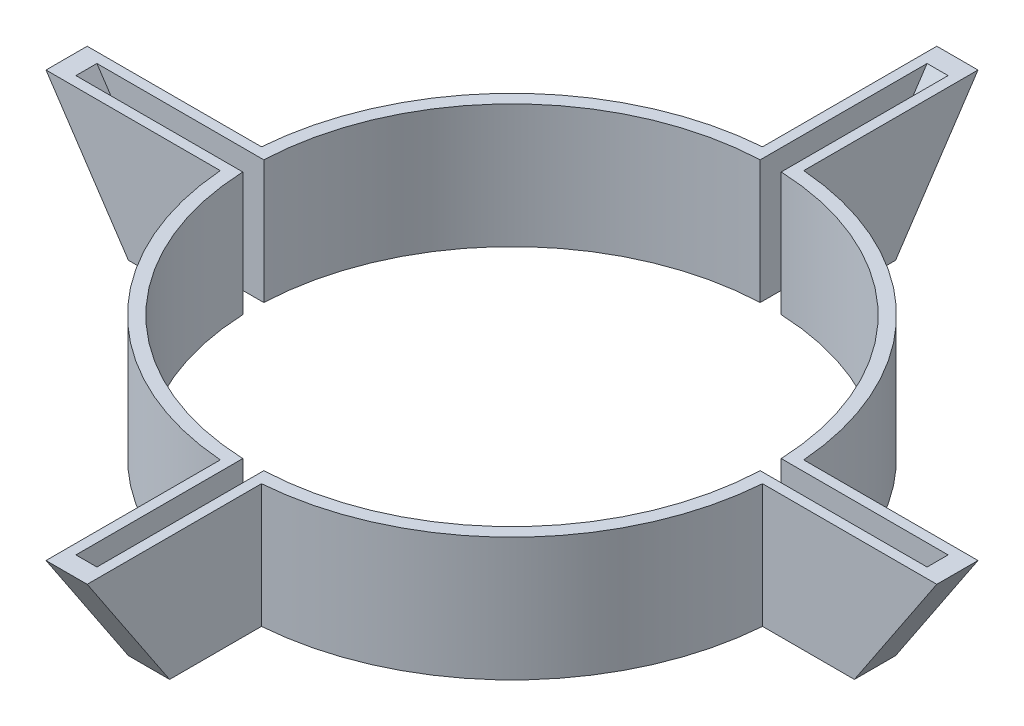
ISO-10303-21;
HEADER;
FILE_DESCRIPTION(('STEP AP214'),'2;1');
FILE_NAME('part.step','',(''),(''),'','','');
FILE_SCHEMA(('AUTOMOTIVE_DESIGN { 1 0 10303 214 1 1 1 1 }'));
ENDSEC;
DATA;
#1=APPLICATION_CONTEXT('core data for automotive mechanical design processes');
#2=APPLICATION_PROTOCOL_DEFINITION('international standard','automotive_design',2000,#1);
#3=PRODUCT_CONTEXT('',#1,'mechanical');
#4=PRODUCT('Part','Part','',(#3));
#5=PRODUCT_RELATED_PRODUCT_CATEGORY('part','',(#4));
#6=PRODUCT_DEFINITION_FORMATION('','',#4);
#7=PRODUCT_DEFINITION_CONTEXT('part definition',#1,'design');
#8=PRODUCT_DEFINITION('design','',#6,#7);
#9=PRODUCT_DEFINITION_SHAPE('','',#8);
#10=(LENGTH_UNIT() NAMED_UNIT(*) SI_UNIT(.MILLI.,.METRE.));
#11=(NAMED_UNIT(*) PLANE_ANGLE_UNIT() SI_UNIT($,.RADIAN.));
#12=(NAMED_UNIT(*) SI_UNIT($,.STERADIAN.) SOLID_ANGLE_UNIT());
#13=UNCERTAINTY_MEASURE_WITH_UNIT(LENGTH_MEASURE(1.E-05),#10,'distance_accuracy_value','');
#14=(GEOMETRIC_REPRESENTATION_CONTEXT(3) GLOBAL_UNCERTAINTY_ASSIGNED_CONTEXT((#13)) GLOBAL_UNIT_ASSIGNED_CONTEXT((#10,
#11,#12)) REPRESENTATION_CONTEXT('',''));
#15=CARTESIAN_POINT('',(0.,0.,0.));
#16=DIRECTION('',(0.,0.,1.));
#17=DIRECTION('',(1.,0.,0.));
#18=AXIS2_PLACEMENT_3D('',#15,#16,#17);
#19=CARTESIAN_POINT('',(-64.2083674284019,-78.044168561766,-1.61925000000022));
#20=DIRECTION('',(0.,0.,-1.));
#21=DIRECTION('',(-1.,0.,0.));
#22=AXIS2_PLACEMENT_3D('',#19,#20,#21);
#23=PLANE('',#22);
#24=DIRECTION('',(0.554699215611406,0.832050948079558,0.));
#25=VECTOR('',#24,1.);
#26=CARTESIAN_POINT('',(-8.36465421005174,-115.273215641808,-1.61925000000003));
#27=LINE('',#26,#25);
#28=CARTESIAN_POINT('',(52.8897682993931,-23.3913472550421,-1.61924999999986));
#29=VERTEX_POINT('',#28);
#30=CARTESIAN_POINT('',(65.5897358696324,-4.34134725504209,-1.61924999999986));
#31=VERTEX_POINT('',#30);
#32=EDGE_CURVE('E269',#29,#31,#27,.T.);
#33=ORIENTED_EDGE('',*,*,#32,.T.);
#34=DIRECTION('',(-1.,0.,0.));
#35=VECTOR('',#34,1.);
#36=CARTESIAN_POINT('',(-64.2083674284019,-4.34134725504209,-1.61925000000022));
#37=LINE('',#36,#35);
#38=CARTESIAN_POINT('',(39.8705324895154,-4.34134725504209,-1.61924999999986));
#39=VERTEX_POINT('',#38);
#40=EDGE_CURVE('E420',#31,#39,#37,.T.);
#41=ORIENTED_EDGE('',*,*,#40,.T.);
#42=DIRECTION('',(0.,-1.,0.));
#43=VECTOR('',#42,1.);
#44=CARTESIAN_POINT('',(39.8705324895154,57.15,-1.61924999999986));
#45=LINE('',#44,#43);
#46=CARTESIAN_POINT('',(39.8705324895154,-23.3913472550421,-1.61924999999986));
#47=VERTEX_POINT('',#46);
#48=EDGE_CURVE('E276',#47,#39,#45,.F.);
#49=ORIENTED_EDGE('',*,*,#48,.F.);
#50=DIRECTION('',(1.,0.,0.));
#51=VECTOR('',#50,1.);
#52=CARTESIAN_POINT('',(-64.2083674284019,-23.3913472550421,-1.61925000000022));
#53=LINE('',#52,#51);
#54=EDGE_CURVE('E419',#47,#29,#53,.T.);
#55=ORIENTED_EDGE('',*,*,#54,.T.);
#56=EDGE_LOOP('',(#33,#41,#49,#55));
#57=FACE_BOUND('',#56,.T.);
#58=ADVANCED_FACE('F43',(#57),#23,.F.);
#59=CARTESIAN_POINT('',(-64.2083674284019,-78.044168561766,1.61924999999978));
#60=DIRECTION('',(0.,0.,1.));
#61=DIRECTION('',(1.,0.,0.));
#62=AXIS2_PLACEMENT_3D('',#59,#60,#61);
#63=PLANE('',#62);
#64=DIRECTION('',(0.,-1.,0.));
#65=VECTOR('',#64,1.);
#66=CARTESIAN_POINT('',(39.8705324895154,57.15,1.61925000000014));
#67=LINE('',#66,#65);
#68=CARTESIAN_POINT('',(39.8705324895154,-4.34134725504209,1.61925000000014));
#69=VERTEX_POINT('',#68);
#70=CARTESIAN_POINT('',(39.8705324895154,-23.3913472550421,1.61925000000014));
#71=VERTEX_POINT('',#70);
#72=EDGE_CURVE('E272',#69,#71,#67,.T.);
#73=ORIENTED_EDGE('',*,*,#72,.F.);
#74=DIRECTION('',(1.,0.,0.));
#75=VECTOR('',#74,1.);
#76=CARTESIAN_POINT('',(-64.2083674284019,-4.34134725504209,1.61924999999978));
#77=LINE('',#76,#75);
#78=CARTESIAN_POINT('',(65.5897358696324,-4.34134725504209,1.61925000000023));
#79=VERTEX_POINT('',#78);
#80=EDGE_CURVE('E11',#69,#79,#77,.T.);
#81=ORIENTED_EDGE('',*,*,#80,.T.);
#82=DIRECTION('',(0.554699215611406,0.832050948079558,0.));
#83=VECTOR('',#82,1.);
#84=CARTESIAN_POINT('',(-8.36465421005174,-115.273215641808,1.61924999999997));
#85=LINE('',#84,#83);
#86=CARTESIAN_POINT('',(52.889768299393,-23.3913472550421,1.61925000000019));
#87=VERTEX_POINT('',#86);
#88=EDGE_CURVE('E267',#87,#79,#85,.T.);
#89=ORIENTED_EDGE('',*,*,#88,.F.);
#90=DIRECTION('',(-1.,0.,0.));
#91=VECTOR('',#90,1.);
#92=CARTESIAN_POINT('',(-64.2083674284019,-23.3913472550421,1.61924999999978));
#93=LINE('',#92,#91);
#94=EDGE_CURVE('E51',#87,#71,#93,.T.);
#95=ORIENTED_EDGE('',*,*,#94,.T.);
#96=EDGE_LOOP('',(#73,#81,#89,#95));
#97=FACE_BOUND('',#96,.T.);
#98=ADVANCED_FACE('F271',(#97),#63,.F.);
#99=CARTESIAN_POINT('',(-8.36465421005174,-115.273215641808,-1.61925000000003));
#100=DIRECTION('',(0.832050948079558,-0.554699215611406,0.));
#101=DIRECTION('',(0.554699215611406,0.832050948079558,0.));
#102=AXIS2_PLACEMENT_3D('',#99,#100,#101);
#103=PLANE('',#102);
#104=ORIENTED_EDGE('',*,*,#88,.T.);
#105=DIRECTION('',(0.,0.,-1.));
#106=VECTOR('',#105,1.);
#107=CARTESIAN_POINT('',(65.5897358696324,-4.34134725504209,-1.61924999999975));
#108=LINE('',#107,#106);
#109=EDGE_CURVE('E428',#79,#31,#108,.T.);
#110=ORIENTED_EDGE('',*,*,#109,.T.);
#111=ORIENTED_EDGE('',*,*,#32,.F.);
#112=DIRECTION('',(0.,0.,1.));
#113=VECTOR('',#112,1.);
#114=CARTESIAN_POINT('',(52.8897682993931,-23.3913472550421,-1.6192499999998));
#115=LINE('',#114,#113);
#116=EDGE_CURVE('E253',#29,#87,#115,.T.);
#117=ORIENTED_EDGE('',*,*,#116,.T.);
#118=EDGE_LOOP('',(#104,#110,#111,#117));
#119=FACE_BOUND('',#118,.T.);
#120=ADVANCED_FACE('F265',(#119),#103,.F.);
#121=CARTESIAN_POINT('',(-1.61925,-53.2855158173118,47.7026410799827));
#122=DIRECTION('',(-1.,0.,0.));
#123=DIRECTION('',(0.,0.,1.));
#124=AXIS2_PLACEMENT_3D('',#121,#122,#123);
#125=PLANE('',#124);
#126=DIRECTION('',(0.,0.832050948079557,-0.554699215611406));
#127=VECTOR('',#126,1.);
#128=CARTESIAN_POINT('',(-1.61925,-90.5145628973535,-8.14107213836744));
#129=LINE('',#128,#127);
#130=CARTESIAN_POINT('',(-1.61925,-23.3913472550421,-52.8897682993931));
#131=VERTEX_POINT('',#130);
#132=CARTESIAN_POINT('',(-1.61925,-4.34134725504208,-65.5897358696324));
#133=VERTEX_POINT('',#132);
#134=EDGE_CURVE('E346',#131,#133,#129,.T.);
#135=ORIENTED_EDGE('',*,*,#134,.T.);
#136=DIRECTION('',(0.,0.,1.));
#137=VECTOR('',#136,1.);
#138=CARTESIAN_POINT('',(-1.61925,-4.3413472550421,47.7026410799827));
#139=LINE('',#138,#137);
#140=CARTESIAN_POINT('',(-1.61925,-4.34134725504209,-39.8705324895154));
#141=VERTEX_POINT('',#140);
#142=EDGE_CURVE('E451',#133,#141,#139,.T.);
#143=ORIENTED_EDGE('',*,*,#142,.T.);
#144=DIRECTION('',(0.,-1.,0.));
#145=VECTOR('',#144,1.);
#146=CARTESIAN_POINT('',(-1.61925,57.15,-39.8705324895154));
#147=LINE('',#146,#145);
#148=CARTESIAN_POINT('',(-1.61925,-23.3913472550421,-39.8705324895153));
#149=VERTEX_POINT('',#148);
#150=EDGE_CURVE('E339',#149,#141,#147,.F.);
#151=ORIENTED_EDGE('',*,*,#150,.F.);
#152=DIRECTION('',(0.,0.,-1.));
#153=VECTOR('',#152,1.);
#154=CARTESIAN_POINT('',(-1.61925,-23.3913472550421,47.7026410799827));
#155=LINE('',#154,#153);
#156=EDGE_CURVE('E540',#149,#131,#155,.T.);
#157=ORIENTED_EDGE('',*,*,#156,.T.);
#158=EDGE_LOOP('',(#135,#143,#151,#157));
#159=FACE_BOUND('',#158,.T.);
#160=ADVANCED_FACE('F535',(#159),#125,.F.);
#161=CARTESIAN_POINT('',(1.61925,-53.2855158173118,47.7026410799827));
#162=DIRECTION('',(1.,0.,0.));
#163=DIRECTION('',(0.,0.,-1.));
#164=AXIS2_PLACEMENT_3D('',#161,#162,#163);
#165=PLANE('',#164);
#166=DIRECTION('',(0.,-1.,0.));
#167=VECTOR('',#166,1.);
#168=CARTESIAN_POINT('',(1.61925,57.15,-39.8705324895154));
#169=LINE('',#168,#167);
#170=CARTESIAN_POINT('',(1.61925,-4.34134725504209,-39.8705324895154));
#171=VERTEX_POINT('',#170);
#172=CARTESIAN_POINT('',(1.61925,-23.3913472550421,-39.8705324895154));
#173=VERTEX_POINT('',#172);
#174=EDGE_CURVE('E342',#171,#173,#169,.T.);
#175=ORIENTED_EDGE('',*,*,#174,.F.);
#176=DIRECTION('',(0.,0.,-1.));
#177=VECTOR('',#176,1.);
#178=CARTESIAN_POINT('',(1.61925,-4.3413472550421,47.7026410799827));
#179=LINE('',#178,#177);
#180=CARTESIAN_POINT('',(1.61925,-4.34134725504208,-65.5897358696324));
#181=VERTEX_POINT('',#180);
#182=EDGE_CURVE('E438',#171,#181,#179,.T.);
#183=ORIENTED_EDGE('',*,*,#182,.T.);
#184=DIRECTION('',(0.,0.832050948079557,-0.554699215611406));
#185=VECTOR('',#184,1.);
#186=CARTESIAN_POINT('',(1.61925,-90.5145628973535,-8.14107213836744));
#187=LINE('',#186,#185);
#188=CARTESIAN_POINT('',(1.61925,-23.3913472550421,-52.8897682993931));
#189=VERTEX_POINT('',#188);
#190=EDGE_CURVE('E345',#189,#181,#187,.T.);
#191=ORIENTED_EDGE('',*,*,#190,.F.);
#192=DIRECTION('',(0.,0.,1.));
#193=VECTOR('',#192,1.);
#194=CARTESIAN_POINT('',(1.61925,-23.3913472550421,47.7026410799827));
#195=LINE('',#194,#193);
#196=EDGE_CURVE('E548',#189,#173,#195,.T.);
#197=ORIENTED_EDGE('',*,*,#196,.T.);
#198=EDGE_LOOP('',(#175,#183,#191,#197));
#199=FACE_BOUND('',#198,.T.);
#200=ADVANCED_FACE('F812',(#199),#165,.F.);
#201=CARTESIAN_POINT('',(-1.61925,-90.5145628973535,-8.14107213836744));
#202=DIRECTION('',(0.,-0.554699215611406,-0.832050948079557));
#203=DIRECTION('',(0.,0.832050948079558,-0.554699215611406));
#204=AXIS2_PLACEMENT_3D('',#201,#202,#203);
#205=PLANE('',#204);
#206=ORIENTED_EDGE('',*,*,#190,.T.);
#207=DIRECTION('',(-1.,0.,0.));
#208=VECTOR('',#207,1.);
#209=CARTESIAN_POINT('',(-1.61925,-4.34134725504208,-65.5897358696324));
#210=LINE('',#209,#208);
#211=EDGE_CURVE('E441',#181,#133,#210,.T.);
#212=ORIENTED_EDGE('',*,*,#211,.T.);
#213=ORIENTED_EDGE('',*,*,#134,.F.);
#214=DIRECTION('',(1.,0.,0.));
#215=VECTOR('',#214,1.);
#216=CARTESIAN_POINT('',(-1.61925,-23.3913472550421,-52.8897682993931));
#217=LINE('',#216,#215);
#218=EDGE_CURVE('E546',#131,#189,#217,.T.);
#219=ORIENTED_EDGE('',*,*,#218,.T.);
#220=EDGE_LOOP('',(#206,#212,#213,#219));
#221=FACE_BOUND('',#220,.T.);
#222=ADVANCED_FACE('F573',(#221),#205,.F.);
#223=CARTESIAN_POINT('',(64.2083674284021,-78.0441685617663,1.61925000000067));
#224=DIRECTION('',(0.,0.,1.));
#225=DIRECTION('',(1.,0.,0.));
#226=AXIS2_PLACEMENT_3D('',#223,#224,#225);
#227=PLANE('',#226);
#228=DIRECTION('',(-0.554699215611406,0.832050948079558,0.));
#229=VECTOR('',#228,1.);
#230=CARTESIAN_POINT('',(8.36465421005192,-115.273215641808,1.61925000000009));
#231=LINE('',#230,#229);
#232=CARTESIAN_POINT('',(-52.8897682993931,-23.3913472550421,1.61924999999944));
#233=VERTEX_POINT('',#232);
#234=CARTESIAN_POINT('',(-65.5897358696324,-4.34134725504209,1.61924999999931));
#235=VERTEX_POINT('',#234);
#236=EDGE_CURVE('E283',#233,#235,#231,.T.);
#237=ORIENTED_EDGE('',*,*,#236,.T.);
#238=DIRECTION('',(1.,0.,0.));
#239=VECTOR('',#238,1.);
#240=CARTESIAN_POINT('',(64.2083674284021,-4.34134725504209,1.61925000000067));
#241=LINE('',#240,#239);
#242=CARTESIAN_POINT('',(-39.8705324895154,-4.34134725504209,1.61924999999958));
#243=VERTEX_POINT('',#242);
#244=EDGE_CURVE('E445',#235,#243,#241,.T.);
#245=ORIENTED_EDGE('',*,*,#244,.T.);
#246=DIRECTION('',(0.,-1.,0.));
#247=VECTOR('',#246,1.);
#248=CARTESIAN_POINT('',(-39.8705324895154,57.15,1.61924999999958));
#249=LINE('',#248,#247);
#250=CARTESIAN_POINT('',(-39.8705324895154,-23.3913472550421,1.61924999999958));
#251=VERTEX_POINT('',#250);
#252=EDGE_CURVE('E292',#251,#243,#249,.F.);
#253=ORIENTED_EDGE('',*,*,#252,.F.);
#254=DIRECTION('',(-1.,0.,0.));
#255=VECTOR('',#254,1.);
#256=CARTESIAN_POINT('',(64.2083674284021,-23.3913472550421,1.61925000000067));
#257=LINE('',#256,#255);
#258=EDGE_CURVE('E545',#251,#233,#257,.T.);
#259=ORIENTED_EDGE('',*,*,#258,.T.);
#260=EDGE_LOOP('',(#237,#245,#253,#259));
#261=FACE_BOUND('',#260,.T.);
#262=ADVANCED_FACE('F566',(#261),#227,.F.);
#263=CARTESIAN_POINT('',(64.2083674284021,-78.0441685617663,-1.61924999999933));
#264=DIRECTION('',(0.,0.,-1.));
#265=DIRECTION('',(-1.,0.,0.));
#266=AXIS2_PLACEMENT_3D('',#263,#264,#265);
#267=PLANE('',#266);
#268=DIRECTION('',(0.,-1.,0.));
#269=VECTOR('',#268,1.);
#270=CARTESIAN_POINT('',(-39.8705324895153,57.15,-1.61925000000042));
#271=LINE('',#270,#269);
#272=CARTESIAN_POINT('',(-39.8705324895153,-4.34134725504209,-1.61925000000042));
#273=VERTEX_POINT('',#272);
#274=CARTESIAN_POINT('',(-39.8705324895153,-23.3913472550421,-1.61925000000042));
#275=VERTEX_POINT('',#274);
#276=EDGE_CURVE('E295',#273,#275,#271,.T.);
#277=ORIENTED_EDGE('',*,*,#276,.F.);
#278=DIRECTION('',(-1.,0.,0.));
#279=VECTOR('',#278,1.);
#280=CARTESIAN_POINT('',(64.2083674284021,-4.34134725504209,-1.61924999999933));
#281=LINE('',#280,#279);
#282=CARTESIAN_POINT('',(-65.5897358696324,-4.34134725504209,-1.61925000000098));
#283=VERTEX_POINT('',#282);
#284=EDGE_CURVE('E454',#273,#283,#281,.T.);
#285=ORIENTED_EDGE('',*,*,#284,.T.);
#286=DIRECTION('',(-0.554699215611406,0.832050948079558,0.));
#287=VECTOR('',#286,1.);
#288=CARTESIAN_POINT('',(8.36465421005195,-115.273215641808,-1.61924999999991));
#289=LINE('',#288,#287);
#290=CARTESIAN_POINT('',(-52.889768299393,-23.3913472550421,-1.61925000000098));
#291=VERTEX_POINT('',#290);
#292=EDGE_CURVE('E299',#291,#283,#289,.T.);
#293=ORIENTED_EDGE('',*,*,#292,.F.);
#294=DIRECTION('',(1.,0.,0.));
#295=VECTOR('',#294,1.);
#296=CARTESIAN_POINT('',(64.2083674284021,-23.3913472550421,-1.61924999999933));
#297=LINE('',#296,#295);
#298=EDGE_CURVE('E469',#291,#275,#297,.T.);
#299=ORIENTED_EDGE('',*,*,#298,.T.);
#300=EDGE_LOOP('',(#277,#285,#293,#299));
#301=FACE_BOUND('',#300,.T.);
#302=ADVANCED_FACE('F564',(#301),#267,.F.);
#303=CARTESIAN_POINT('',(8.36465421005192,-115.273215641808,1.61925000000009));
#304=DIRECTION('',(-0.832050948079558,-0.554699215611406,0.));
#305=DIRECTION('',(0.554699215611406,-0.832050948079558,0.));
#306=AXIS2_PLACEMENT_3D('',#303,#304,#305);
#307=PLANE('',#306);
#308=ORIENTED_EDGE('',*,*,#292,.T.);
#309=DIRECTION('',(0.,0.,1.));
#310=VECTOR('',#309,1.);
#311=CARTESIAN_POINT('',(-65.5897358696324,-4.34134725504209,1.61924999999933));
#312=LINE('',#311,#310);
#313=EDGE_CURVE('E448',#283,#235,#312,.T.);
#314=ORIENTED_EDGE('',*,*,#313,.T.);
#315=ORIENTED_EDGE('',*,*,#236,.F.);
#316=DIRECTION('',(0.,0.,-1.));
#317=VECTOR('',#316,1.);
#318=CARTESIAN_POINT('',(-52.8897682993931,-23.3913472550421,1.61924999999946));
#319=LINE('',#318,#317);
#320=EDGE_CURVE('E543',#233,#291,#319,.T.);
#321=ORIENTED_EDGE('',*,*,#320,.T.);
#322=EDGE_LOOP('',(#308,#314,#315,#321));
#323=FACE_BOUND('',#322,.T.);
#324=ADVANCED_FACE('F562',(#323),#307,.F.);
#325=CARTESIAN_POINT('',(1.61925,-78.0441685617658,-64.2083674284018));
#326=DIRECTION('',(1.,0.,0.));
#327=DIRECTION('',(0.,0.,-1.));
#328=AXIS2_PLACEMENT_3D('',#325,#326,#327);
#329=PLANE('',#328);
#330=DIRECTION('',(0.,0.832050948079557,0.554699215611406));
#331=VECTOR('',#330,1.);
#332=CARTESIAN_POINT('',(1.61925,-115.273215641807,-8.36465421005162));
#333=LINE('',#332,#331);
#334=CARTESIAN_POINT('',(1.61925,-23.3913472550421,52.889768299393));
#335=VERTEX_POINT('',#334);
#336=CARTESIAN_POINT('',(1.61925,-4.3413472550421,65.5897358696324));
#337=VERTEX_POINT('',#336);
#338=EDGE_CURVE('E287',#335,#337,#333,.T.);
#339=ORIENTED_EDGE('',*,*,#338,.T.);
#340=DIRECTION('',(0.,0.,-1.));
#341=VECTOR('',#340,1.);
#342=CARTESIAN_POINT('',(1.61925,-4.34134725504208,-64.2083674284018));
#343=LINE('',#342,#341);
#344=CARTESIAN_POINT('',(1.61925,-4.3413472550421,39.8705324895154));
#345=VERTEX_POINT('',#344);
#346=EDGE_CURVE('E422',#337,#345,#343,.T.);
#347=ORIENTED_EDGE('',*,*,#346,.T.);
#348=DIRECTION('',(0.,-1.,0.));
#349=VECTOR('',#348,1.);
#350=CARTESIAN_POINT('',(1.61925,57.15,39.8705324895154));
#351=LINE('',#350,#349);
#352=CARTESIAN_POINT('',(1.61925,-23.3913472550421,39.8705324895154));
#353=VERTEX_POINT('',#352);
#354=EDGE_CURVE('E279',#353,#345,#351,.F.);
#355=ORIENTED_EDGE('',*,*,#354,.F.);
#356=DIRECTION('',(0.,0.,1.));
#357=VECTOR('',#356,1.);
#358=CARTESIAN_POINT('',(1.61925,-23.3913472550421,-64.2083674284018));
#359=LINE('',#358,#357);
#360=EDGE_CURVE('E513',#353,#335,#359,.T.);
#361=ORIENTED_EDGE('',*,*,#360,.T.);
#362=EDGE_LOOP('',(#339,#347,#355,#361));
#363=FACE_BOUND('',#362,.T.);
#364=ADVANCED_FACE('F512',(#363),#329,.F.);
#365=CARTESIAN_POINT('',(-1.61925,-78.0441685617658,-64.2083674284018));
#366=DIRECTION('',(-1.,0.,0.));
#367=DIRECTION('',(0.,0.,1.));
#368=AXIS2_PLACEMENT_3D('',#365,#366,#367);
#369=PLANE('',#368);
#370=DIRECTION('',(0.,-1.,0.));
#371=VECTOR('',#370,1.);
#372=CARTESIAN_POINT('',(-1.61925,57.15,39.8705324895154));
#373=LINE('',#372,#371);
#374=CARTESIAN_POINT('',(-1.61925,-4.34134725504209,39.8705324895153));
#375=VERTEX_POINT('',#374);
#376=CARTESIAN_POINT('',(-1.61925,-23.3913472550421,39.8705324895154));
#377=VERTEX_POINT('',#376);
#378=EDGE_CURVE('E282',#375,#377,#373,.T.);
#379=ORIENTED_EDGE('',*,*,#378,.F.);
#380=DIRECTION('',(0.,0.,1.));
#381=VECTOR('',#380,1.);
#382=CARTESIAN_POINT('',(-1.61925,-4.34134725504208,-64.2083674284018));
#383=LINE('',#382,#381);
#384=CARTESIAN_POINT('',(-1.61925,-4.34134725504209,65.5897358696324));
#385=VERTEX_POINT('',#384);
#386=EDGE_CURVE('E435',#375,#385,#383,.T.);
#387=ORIENTED_EDGE('',*,*,#386,.T.);
#388=DIRECTION('',(0.,0.832050948079557,0.554699215611406));
#389=VECTOR('',#388,1.);
#390=CARTESIAN_POINT('',(-1.61925,-115.273215641807,-8.36465421005162));
#391=LINE('',#390,#389);
#392=CARTESIAN_POINT('',(-1.61925,-23.3913472550421,52.889768299393));
#393=VERTEX_POINT('',#392);
#394=EDGE_CURVE('E286',#393,#385,#391,.T.);
#395=ORIENTED_EDGE('',*,*,#394,.F.);
#396=DIRECTION('',(0.,0.,-1.));
#397=VECTOR('',#396,1.);
#398=CARTESIAN_POINT('',(-1.61925,-23.3913472550421,-64.2083674284018));
#399=LINE('',#398,#397);
#400=EDGE_CURVE('E524',#393,#377,#399,.T.);
#401=ORIENTED_EDGE('',*,*,#400,.T.);
#402=EDGE_LOOP('',(#379,#387,#395,#401));
#403=FACE_BOUND('',#402,.T.);
#404=ADVANCED_FACE('F523',(#403),#369,.F.);
#405=CARTESIAN_POINT('',(1.61925,-115.273215641807,-8.36465421005162));
#406=DIRECTION('',(0.,-0.554699215611406,0.832050948079557));
#407=DIRECTION('',(0.,-0.832050948079558,-0.554699215611406));
#408=AXIS2_PLACEMENT_3D('',#405,#406,#407);
#409=PLANE('',#408);
#410=ORIENTED_EDGE('',*,*,#394,.T.);
#411=DIRECTION('',(1.,0.,0.));
#412=VECTOR('',#411,1.);
#413=CARTESIAN_POINT('',(1.61925,-4.34134725504209,65.5897358696324));
#414=LINE('',#413,#412);
#415=EDGE_CURVE('E426',#385,#337,#414,.T.);
#416=ORIENTED_EDGE('',*,*,#415,.T.);
#417=ORIENTED_EDGE('',*,*,#338,.F.);
#418=DIRECTION('',(-1.,0.,0.));
#419=VECTOR('',#418,1.);
#420=CARTESIAN_POINT('',(1.61925,-23.3913472550421,52.889768299393));
#421=LINE('',#420,#419);
#422=EDGE_CURVE('E519',#335,#393,#421,.T.);
#423=ORIENTED_EDGE('',*,*,#422,.T.);
#424=EDGE_LOOP('',(#410,#416,#417,#423));
#425=FACE_BOUND('',#424,.T.);
#426=ADVANCED_FACE('F516',(#425),#409,.F.);
#427=CARTESIAN_POINT('',(0.,57.15,0.));
#428=DIRECTION('',(0.,-1.,0.));
#429=DIRECTION('',(0.,0.,-1.));
#430=AXIS2_PLACEMENT_3D('',#427,#428,#429);
#431=CYLINDRICAL_SURFACE('',#430,39.9034);
#432=CARTESIAN_POINT('',(0.,-4.34134725504209,0.));
#433=DIRECTION('',(0.,-1.,0.));
#434=DIRECTION('',(0.,0.,-1.));
#435=AXIS2_PLACEMENT_3D('',#432,#433,#434);
#436=CIRCLE('',#435,39.9034);
#437=EDGE_CURVE('E444',#375,#243,#436,.T.);
#438=ORIENTED_EDGE('',*,*,#437,.F.);
#439=ORIENTED_EDGE('',*,*,#378,.T.);
#440=CARTESIAN_POINT('',(0.,-23.3913472550421,0.));
#441=DIRECTION('',(0.,1.,0.));
#442=DIRECTION('',(0.,0.,1.));
#443=AXIS2_PLACEMENT_3D('',#440,#441,#442);
#444=CIRCLE('',#443,39.9034);
#445=EDGE_CURVE('E542',#251,#377,#444,.T.);
#446=ORIENTED_EDGE('',*,*,#445,.F.);
#447=ORIENTED_EDGE('',*,*,#252,.T.);
#448=EDGE_LOOP('',(#438,#439,#446,#447));
#449=FACE_BOUND('',#448,.T.);
#450=ADVANCED_FACE('F527',(#449),#431,.F.);
#451=EDGE_CURVE('E430',#273,#141,#436,.T.);
#452=ORIENTED_EDGE('',*,*,#451,.F.);
#453=ORIENTED_EDGE('',*,*,#276,.T.);
#454=EDGE_CURVE('E474',#149,#275,#444,.T.);
#455=ORIENTED_EDGE('',*,*,#454,.F.);
#456=ORIENTED_EDGE('',*,*,#150,.T.);
#457=EDGE_LOOP('',(#452,#453,#455,#456));
#458=FACE_BOUND('',#457,.T.);
#459=ADVANCED_FACE('F539',(#458),#431,.F.);
#460=EDGE_CURVE('E414',#171,#39,#436,.T.);
#461=ORIENTED_EDGE('',*,*,#460,.F.);
#462=ORIENTED_EDGE('',*,*,#174,.T.);
#463=EDGE_CURVE('E416',#47,#173,#444,.T.);
#464=ORIENTED_EDGE('',*,*,#463,.F.);
#465=ORIENTED_EDGE('',*,*,#48,.T.);
#466=EDGE_LOOP('',(#461,#462,#464,#465));
#467=FACE_BOUND('',#466,.T.);
#468=ADVANCED_FACE('F413',(#467),#431,.F.);
#469=EDGE_CURVE('E423',#69,#345,#436,.T.);
#470=ORIENTED_EDGE('',*,*,#469,.F.);
#471=ORIENTED_EDGE('',*,*,#72,.T.);
#472=EDGE_CURVE('E256',#353,#71,#444,.T.);
#473=ORIENTED_EDGE('',*,*,#472,.F.);
#474=ORIENTED_EDGE('',*,*,#354,.T.);
#475=EDGE_LOOP('',(#470,#471,#473,#474));
#476=FACE_BOUND('',#475,.T.);
#477=ADVANCED_FACE('F508',(#476),#431,.F.);
#478=CARTESIAN_POINT('',(-95.5472002980803,-23.3913472550421,-95.5472002980802));
#479=DIRECTION('',(0.,1.,0.));
#480=DIRECTION('',(0.,0.,1.));
#481=AXIS2_PLACEMENT_3D('',#478,#479,#480);
#482=PLANE('',#481);
#483=DIRECTION('',(0.,0.,1.));
#484=VECTOR('',#483,1.);
#485=CARTESIAN_POINT('',(55.9424659807821,-23.3913472550421,1.96836643995336E-13));
#486=LINE('',#485,#484);
#487=CARTESIAN_POINT('',(55.9424659807821,-23.3913472550421,-3.1749999999998));
#488=VERTEX_POINT('',#487);
#489=CARTESIAN_POINT('',(55.942465980782,-23.3913472550421,3.17500000000017));
#490=VERTEX_POINT('',#489);
#491=EDGE_CURVE('E504',#488,#490,#486,.T.);
#492=ORIENTED_EDGE('',*,*,#491,.T.);
#493=DIRECTION('',(1.,0.,0.));
#494=VECTOR('',#493,1.);
#495=CARTESIAN_POINT('',(-16.1550009591508,-23.3913472550421,3.17499999999993));
#496=LINE('',#495,#494);
#497=CARTESIAN_POINT('',(41.7829427704655,-23.3913472550421,3.17500000000013));
#498=VERTEX_POINT('',#497);
#499=EDGE_CURVE('E501',#498,#490,#496,.T.);
#500=ORIENTED_EDGE('',*,*,#499,.F.);
#501=CARTESIAN_POINT('',(0.,-23.3913472550421,0.));
#502=DIRECTION('',(0.,1.,0.));
#503=DIRECTION('',(0.,0.,1.));
#504=AXIS2_PLACEMENT_3D('',#501,#502,#503);
#505=CIRCLE('',#504,41.9034);
#506=CARTESIAN_POINT('',(3.17499999999999,-23.3913472550421,41.7829427704655));
#507=VERTEX_POINT('',#506);
#508=EDGE_CURVE('E482',#507,#498,#505,.T.);
#509=ORIENTED_EDGE('',*,*,#508,.F.);
#510=DIRECTION('',(0.,0.,-1.));
#511=VECTOR('',#510,1.);
#512=CARTESIAN_POINT('',(3.17499999999995,-23.3913472550421,-106.936875206892));
#513=LINE('',#512,#511);
#514=CARTESIAN_POINT('',(3.17500000000003,-23.3913472550421,55.9424659807821));
#515=VERTEX_POINT('',#514);
#516=EDGE_CURVE('E489',#515,#507,#513,.T.);
#517=ORIENTED_EDGE('',*,*,#516,.F.);
#518=DIRECTION('',(-1.,0.,0.));
#519=VECTOR('',#518,1.);
#520=CARTESIAN_POINT('',(0.,-23.3913472550421,55.9424659807821));
#521=LINE('',#520,#519);
#522=CARTESIAN_POINT('',(-3.17499999999998,-23.3913472550421,55.942465980782));
#523=VERTEX_POINT('',#522);
#524=EDGE_CURVE('E486',#515,#523,#521,.T.);
#525=ORIENTED_EDGE('',*,*,#524,.T.);
#526=DIRECTION('',(0.,0.,1.));
#527=VECTOR('',#526,1.);
#528=CARTESIAN_POINT('',(-3.17499999999999,-23.3913472550421,-53.2930749088117));
#529=LINE('',#528,#527);
#530=CARTESIAN_POINT('',(-3.17499999999997,-23.3913472550421,41.7829427704656));
#531=VERTEX_POINT('',#530);
#532=EDGE_CURVE('E483',#531,#523,#529,.T.);
#533=ORIENTED_EDGE('',*,*,#532,.F.);
#534=CARTESIAN_POINT('',(-41.7829427704656,-23.3913472550421,3.17499999999955));
#535=VERTEX_POINT('',#534);
#536=EDGE_CURVE('E479',#535,#531,#505,.T.);
#537=ORIENTED_EDGE('',*,*,#536,.F.);
#538=DIRECTION('',(1.,0.,0.));
#539=VECTOR('',#538,1.);
#540=CARTESIAN_POINT('',(69.798801257231,-23.3913472550421,3.17500000000069));
#541=LINE('',#540,#539);
#542=CARTESIAN_POINT('',(-55.9424659807821,-23.3913472550421,3.17499999999941));
#543=VERTEX_POINT('',#542);
#544=EDGE_CURVE('E58',#543,#535,#541,.T.);
#545=ORIENTED_EDGE('',*,*,#544,.F.);
#546=DIRECTION('',(0.,0.,-1.));
#547=VECTOR('',#546,1.);
#548=CARTESIAN_POINT('',(-55.9424659807821,-23.3913472550421,-5.84451660087734E-13));
#549=LINE('',#548,#547);
#550=CARTESIAN_POINT('',(-55.942465980782,-23.3913472550421,-3.17500000000097));
#551=VERTEX_POINT('',#550);
#552=EDGE_CURVE('E467',#543,#551,#549,.T.);
#553=ORIENTED_EDGE('',*,*,#552,.T.);
#554=DIRECTION('',(-1.,0.,0.));
#555=VECTOR('',#554,1.);
#556=CARTESIAN_POINT('',(16.1550009591509,-23.3913472550421,-3.17499999999982));
#557=LINE('',#556,#555);
#558=CARTESIAN_POINT('',(-41.7829427704655,-23.3913472550421,-3.17500000000042));
#559=VERTEX_POINT('',#558);
#560=EDGE_CURVE('E471',#559,#551,#557,.T.);
#561=ORIENTED_EDGE('',*,*,#560,.F.);
#562=CARTESIAN_POINT('',(-3.175,-23.3913472550421,-41.7829427704656));
#563=VERTEX_POINT('',#562);
#564=EDGE_CURVE('E373',#563,#559,#505,.T.);
#565=ORIENTED_EDGE('',*,*,#564,.F.);
#566=DIRECTION('',(0.,0.,1.));
#567=VECTOR('',#566,1.);
#568=CARTESIAN_POINT('',(-3.17499999999996,-23.3913472550421,63.0101989653047));
#569=LINE('',#568,#567);
#570=CARTESIAN_POINT('',(-3.17499999999999,-23.3913472550421,-55.9424659807821));
#571=VERTEX_POINT('',#570);
#572=EDGE_CURVE('E368',#571,#563,#569,.T.);
#573=ORIENTED_EDGE('',*,*,#572,.F.);
#574=DIRECTION('',(1.,0.,0.));
#575=VECTOR('',#574,1.);
#576=CARTESIAN_POINT('',(0.,-23.3913472550421,-55.9424659807821));
#577=LINE('',#576,#575);
#578=CARTESIAN_POINT('',(3.17499999999998,-23.3913472550421,-55.9424659807821));
#579=VERTEX_POINT('',#578);
#580=EDGE_CURVE('E492',#571,#579,#577,.T.);
#581=ORIENTED_EDGE('',*,*,#580,.T.);
#582=DIRECTION('',(0.,0.,-1.));
#583=VECTOR('',#582,1.);
#584=CARTESIAN_POINT('',(3.17499999999998,-23.3913472550421,9.36639866722445));
#585=LINE('',#584,#583);
#586=CARTESIAN_POINT('',(3.17499999999998,-23.3913472550421,-41.7829427704656));
#587=VERTEX_POINT('',#586);
#588=EDGE_CURVE('E494',#587,#579,#585,.T.);
#589=ORIENTED_EDGE('',*,*,#588,.F.);
#590=CARTESIAN_POINT('',(41.7829427704656,-23.3913472550421,-3.17499999999985));
#591=VERTEX_POINT('',#590);
#592=EDGE_CURVE('E497',#591,#587,#505,.T.);
#593=ORIENTED_EDGE('',*,*,#592,.F.);
#594=DIRECTION('',(-1.,0.,0.));
#595=VECTOR('',#594,1.);
#596=CARTESIAN_POINT('',(-69.7988012572309,-23.3913472550421,-3.1750000000002));
#597=LINE('',#596,#595);
#598=EDGE_CURVE('E498',#488,#591,#597,.T.);
#599=ORIENTED_EDGE('',*,*,#598,.F.);
#600=EDGE_LOOP('',(#492,#500,#509,#517,#525,#533,#537,#545,#553,#561,#565,#573,#581,#589,#593,#599));
#601=FACE_BOUND('',#600,.T.);
#602=ORIENTED_EDGE('',*,*,#320,.F.);
#603=ORIENTED_EDGE('',*,*,#258,.F.);
#604=ORIENTED_EDGE('',*,*,#445,.T.);
#605=ORIENTED_EDGE('',*,*,#400,.F.);
#606=ORIENTED_EDGE('',*,*,#422,.F.);
#607=ORIENTED_EDGE('',*,*,#360,.F.);
#608=ORIENTED_EDGE('',*,*,#472,.T.);
#609=ORIENTED_EDGE('',*,*,#94,.F.);
#610=ORIENTED_EDGE('',*,*,#116,.F.);
#611=ORIENTED_EDGE('',*,*,#54,.F.);
#612=ORIENTED_EDGE('',*,*,#463,.T.);
#613=ORIENTED_EDGE('',*,*,#196,.F.);
#614=ORIENTED_EDGE('',*,*,#218,.F.);
#615=ORIENTED_EDGE('',*,*,#156,.F.);
#616=ORIENTED_EDGE('',*,*,#454,.T.);
#617=ORIENTED_EDGE('',*,*,#298,.F.);
#618=EDGE_LOOP('',(#602,#603,#604,#605,#606,#607,#608,#609,#610,#611,#612,#613,#614,#615,#616,#617));
#619=FACE_BOUND('',#618,.T.);
#620=ADVANCED_FACE('F252',(#601,#619),#482,.F.);
#621=CARTESIAN_POINT('',(-95.5472002980803,-4.34134725504208,-95.5472002980802));
#622=DIRECTION('',(0.,-1.,0.));
#623=DIRECTION('',(0.,0.,-1.));
#624=AXIS2_PLACEMENT_3D('',#621,#622,#623);
#625=PLANE('',#624);
#626=DIRECTION('',(0.,0.,-1.));
#627=VECTOR('',#626,1.);
#628=CARTESIAN_POINT('',(68.6424335510214,-4.3413472550421,2.44927850984177E-13));
#629=LINE('',#628,#627);
#630=CARTESIAN_POINT('',(68.6424335510214,-4.3413472550421,3.17500000000022));
#631=VERTEX_POINT('',#630);
#632=CARTESIAN_POINT('',(68.6424335510214,-4.3413472550421,-3.17499999999977));
#633=VERTEX_POINT('',#632);
#634=EDGE_CURVE('E296',#631,#633,#629,.T.);
#635=ORIENTED_EDGE('',*,*,#634,.T.);
#636=DIRECTION('',(1.,0.,0.));
#637=VECTOR('',#636,1.);
#638=CARTESIAN_POINT('',(-69.7988012572309,-4.34134725504209,-3.17500000000021));
#639=LINE('',#638,#637);
#640=CARTESIAN_POINT('',(41.7829427704656,-4.34134725504209,-3.17499999999985));
#641=VERTEX_POINT('',#640);
#642=EDGE_CURVE('E386',#641,#633,#639,.T.);
#643=ORIENTED_EDGE('',*,*,#642,.F.);
#644=CARTESIAN_POINT('',(0.,-4.34134725504209,0.));
#645=DIRECTION('',(0.,-1.,0.));
#646=DIRECTION('',(0.,0.,-1.));
#647=AXIS2_PLACEMENT_3D('',#644,#645,#646);
#648=CIRCLE('',#647,41.9034);
#649=CARTESIAN_POINT('',(3.17499999999998,-4.34134725504209,-41.7829427704656));
#650=VERTEX_POINT('',#649);
#651=EDGE_CURVE('E378',#650,#641,#648,.T.);
#652=ORIENTED_EDGE('',*,*,#651,.F.);
#653=DIRECTION('',(0.,0.,1.));
#654=VECTOR('',#653,1.);
#655=CARTESIAN_POINT('',(3.17499999999998,-4.34134725504209,9.36639866722445));
#656=LINE('',#655,#654);
#657=CARTESIAN_POINT('',(3.17499999999998,-4.34134725504208,-68.6424335510214));
#658=VERTEX_POINT('',#657);
#659=EDGE_CURVE('E393',#658,#650,#656,.T.);
#660=ORIENTED_EDGE('',*,*,#659,.F.);
#661=DIRECTION('',(-1.,0.,0.));
#662=VECTOR('',#661,1.);
#663=CARTESIAN_POINT('',(0.,-4.34134725504208,-68.6424335510214));
#664=LINE('',#663,#662);
#665=CARTESIAN_POINT('',(-3.17500000000001,-4.34134725504208,-68.6424335510214));
#666=VERTEX_POINT('',#665);
#667=EDGE_CURVE('E397',#658,#666,#664,.T.);
#668=ORIENTED_EDGE('',*,*,#667,.T.);
#669=DIRECTION('',(0.,0.,-1.));
#670=VECTOR('',#669,1.);
#671=CARTESIAN_POINT('',(-3.17499999999997,-4.3413472550421,63.0101989653047));
#672=LINE('',#671,#670);
#673=CARTESIAN_POINT('',(-3.175,-4.34134725504209,-41.7829427704656));
#674=VERTEX_POINT('',#673);
#675=EDGE_CURVE('E366',#674,#666,#672,.T.);
#676=ORIENTED_EDGE('',*,*,#675,.F.);
#677=CARTESIAN_POINT('',(-41.7829427704655,-4.34134725504209,-3.17500000000042));
#678=VERTEX_POINT('',#677);
#679=EDGE_CURVE('E375',#678,#674,#648,.T.);
#680=ORIENTED_EDGE('',*,*,#679,.F.);
#681=DIRECTION('',(1.,0.,0.));
#682=VECTOR('',#681,1.);
#683=CARTESIAN_POINT('',(16.1550009591509,-4.34134725504209,-3.17499999999981));
#684=LINE('',#683,#682);
#685=CARTESIAN_POINT('',(-68.6424335510214,-4.34134725504207,-3.1750000000007));
#686=VERTEX_POINT('',#685);
#687=EDGE_CURVE('E66',#686,#678,#684,.T.);
#688=ORIENTED_EDGE('',*,*,#687,.F.);
#689=DIRECTION('',(0.,0.,1.));
#690=VECTOR('',#689,1.);
#691=CARTESIAN_POINT('',(-68.6424335510214,-4.34134725504209,-7.13727252200508E-13));
#692=LINE('',#691,#690);
#693=CARTESIAN_POINT('',(-68.6424335510215,-4.34134725504209,3.17499999999954));
#694=VERTEX_POINT('',#693);
#695=EDGE_CURVE('E457',#686,#694,#692,.T.);
#696=ORIENTED_EDGE('',*,*,#695,.T.);
#697=DIRECTION('',(-1.,0.,0.));
#698=VECTOR('',#697,1.);
#699=CARTESIAN_POINT('',(69.798801257231,-4.34134725504209,3.1750000000007));
#700=LINE('',#699,#698);
#701=CARTESIAN_POINT('',(-41.7829427704656,-4.34134725504209,3.17499999999956));
#702=VERTEX_POINT('',#701);
#703=EDGE_CURVE('E382',#702,#694,#700,.T.);
#704=ORIENTED_EDGE('',*,*,#703,.F.);
#705=CARTESIAN_POINT('',(-3.17499999999997,-4.3413472550421,41.7829427704656));
#706=VERTEX_POINT('',#705);
#707=EDGE_CURVE('E376',#706,#702,#648,.T.);
#708=ORIENTED_EDGE('',*,*,#707,.F.);
#709=DIRECTION('',(0.,0.,-1.));
#710=VECTOR('',#709,1.);
#711=CARTESIAN_POINT('',(-3.17499999999999,-4.34134725504209,-53.2930749088117));
#712=LINE('',#711,#710);
#713=CARTESIAN_POINT('',(-3.17499999999998,-4.34134725504211,68.6424335510214));
#714=VERTEX_POINT('',#713);
#715=EDGE_CURVE('E380',#714,#706,#712,.T.);
#716=ORIENTED_EDGE('',*,*,#715,.F.);
#717=DIRECTION('',(1.,0.,0.));
#718=VECTOR('',#717,1.);
#719=CARTESIAN_POINT('',(0.,-4.3413472550421,68.6424335510214));
#720=LINE('',#719,#718);
#721=CARTESIAN_POINT('',(3.17500000000003,-4.3413472550421,68.6424335510214));
#722=VERTEX_POINT('',#721);
#723=EDGE_CURVE('E856',#714,#722,#720,.T.);
#724=ORIENTED_EDGE('',*,*,#723,.T.);
#725=DIRECTION('',(0.,0.,1.));
#726=VECTOR('',#725,1.);
#727=CARTESIAN_POINT('',(3.17499999999996,-4.34134725504208,-106.936875206892));
#728=LINE('',#727,#726);
#729=CARTESIAN_POINT('',(3.175,-4.3413472550421,41.7829427704655));
#730=VERTEX_POINT('',#729);
#731=EDGE_CURVE('E401',#730,#722,#728,.T.);
#732=ORIENTED_EDGE('',*,*,#731,.F.);
#733=CARTESIAN_POINT('',(41.7829427704655,-4.34134725504209,3.17500000000013));
#734=VERTEX_POINT('',#733);
#735=EDGE_CURVE('E381',#734,#730,#648,.T.);
#736=ORIENTED_EDGE('',*,*,#735,.F.);
#737=DIRECTION('',(-1.,0.,0.));
#738=VECTOR('',#737,1.);
#739=CARTESIAN_POINT('',(-16.1550009591508,-4.34134725504209,3.17499999999993));
#740=LINE('',#739,#738);
#741=EDGE_CURVE('E390',#631,#734,#740,.T.);
#742=ORIENTED_EDGE('',*,*,#741,.F.);
#743=EDGE_LOOP('',(#635,#643,#652,#660,#668,#676,#680,#688,#696,#704,#708,#716,#724,#732,#736,#742));
#744=FACE_BOUND('',#743,.T.);
#745=ORIENTED_EDGE('',*,*,#451,.T.);
#746=ORIENTED_EDGE('',*,*,#142,.F.);
#747=ORIENTED_EDGE('',*,*,#211,.F.);
#748=ORIENTED_EDGE('',*,*,#182,.F.);
#749=ORIENTED_EDGE('',*,*,#460,.T.);
#750=ORIENTED_EDGE('',*,*,#40,.F.);
#751=ORIENTED_EDGE('',*,*,#109,.F.);
#752=ORIENTED_EDGE('',*,*,#80,.F.);
#753=ORIENTED_EDGE('',*,*,#469,.T.);
#754=ORIENTED_EDGE('',*,*,#346,.F.);
#755=ORIENTED_EDGE('',*,*,#415,.F.);
#756=ORIENTED_EDGE('',*,*,#386,.F.);
#757=ORIENTED_EDGE('',*,*,#437,.T.);
#758=ORIENTED_EDGE('',*,*,#244,.F.);
#759=ORIENTED_EDGE('',*,*,#313,.F.);
#760=ORIENTED_EDGE('',*,*,#284,.F.);
#761=EDGE_LOOP('',(#745,#746,#747,#748,#749,#750,#751,#752,#753,#754,#755,#756,#757,#758,#759,#760));
#762=FACE_BOUND('',#761,.T.);
#763=ADVANCED_FACE('F505',(#744,#762),#625,.F.);
#764=CARTESIAN_POINT('',(0.,57.15,0.));
#765=DIRECTION('',(0.,-1.,0.));
#766=DIRECTION('',(0.,0.,-1.));
#767=AXIS2_PLACEMENT_3D('',#764,#765,#766);
#768=CYLINDRICAL_SURFACE('',#767,41.9034);
#769=DIRECTION('',(0.,-1.,0.));
#770=VECTOR('',#769,1.);
#771=CARTESIAN_POINT('',(41.7829427704655,57.15,3.17500000000012));
#772=LINE('',#771,#770);
#773=EDGE_CURVE('E331',#498,#734,#772,.F.);
#774=ORIENTED_EDGE('',*,*,#773,.T.);
#775=ORIENTED_EDGE('',*,*,#735,.T.);
#776=DIRECTION('',(0.,-1.,0.));
#777=VECTOR('',#776,1.);
#778=CARTESIAN_POINT('',(3.17500000000002,57.15,41.7829427704656));
#779=LINE('',#778,#777);
#780=EDGE_CURVE('E315',#730,#507,#779,.T.);
#781=ORIENTED_EDGE('',*,*,#780,.T.);
#782=ORIENTED_EDGE('',*,*,#508,.T.);
#783=EDGE_LOOP('',(#774,#775,#781,#782));
#784=FACE_BOUND('',#783,.T.);
#785=ADVANCED_FACE('F642',(#784),#768,.T.);
#786=DIRECTION('',(0.,-1.,0.));
#787=VECTOR('',#786,1.);
#788=CARTESIAN_POINT('',(3.17499999999997,57.15,-41.7829427704656));
#789=LINE('',#788,#787);
#790=EDGE_CURVE('E355',#587,#650,#789,.F.);
#791=ORIENTED_EDGE('',*,*,#790,.T.);
#792=ORIENTED_EDGE('',*,*,#651,.T.);
#793=DIRECTION('',(0.,-1.,0.));
#794=VECTOR('',#793,1.);
#795=CARTESIAN_POINT('',(41.7829427704656,57.15,-3.17499999999988));
#796=LINE('',#795,#794);
#797=EDGE_CURVE('E336',#641,#591,#796,.T.);
#798=ORIENTED_EDGE('',*,*,#797,.T.);
#799=ORIENTED_EDGE('',*,*,#592,.T.);
#800=EDGE_LOOP('',(#791,#792,#798,#799));
#801=FACE_BOUND('',#800,.T.);
#802=ADVANCED_FACE('F649',(#801),#768,.T.);
#803=DIRECTION('',(0.,-1.,0.));
#804=VECTOR('',#803,1.);
#805=CARTESIAN_POINT('',(-41.7829427704655,57.15,-3.17500000000041));
#806=LINE('',#805,#804);
#807=EDGE_CURVE('E307',#559,#678,#806,.F.);
#808=ORIENTED_EDGE('',*,*,#807,.T.);
#809=ORIENTED_EDGE('',*,*,#679,.T.);
#810=DIRECTION('',(0.,-1.,0.));
#811=VECTOR('',#810,1.);
#812=CARTESIAN_POINT('',(-3.17500000000002,57.15,-41.7829427704656));
#813=LINE('',#812,#811);
#814=EDGE_CURVE('E261',#563,#674,#813,.F.);
#815=ORIENTED_EDGE('',*,*,#814,.F.);
#816=ORIENTED_EDGE('',*,*,#564,.T.);
#817=EDGE_LOOP('',(#808,#809,#815,#816));
#818=FACE_BOUND('',#817,.T.);
#819=ADVANCED_FACE('F372',(#818),#768,.T.);
#820=DIRECTION('',(0.,-1.,0.));
#821=VECTOR('',#820,1.);
#822=CARTESIAN_POINT('',(-3.17499999999997,57.15,41.7829427704656));
#823=LINE('',#822,#821);
#824=EDGE_CURVE('E318',#531,#706,#823,.F.);
#825=ORIENTED_EDGE('',*,*,#824,.T.);
#826=ORIENTED_EDGE('',*,*,#707,.T.);
#827=DIRECTION('',(0.,-1.,0.));
#828=VECTOR('',#827,1.);
#829=CARTESIAN_POINT('',(-41.7829427704656,57.15,3.17499999999959));
#830=LINE('',#829,#828);
#831=EDGE_CURVE('E312',#702,#535,#830,.T.);
#832=ORIENTED_EDGE('',*,*,#831,.T.);
#833=ORIENTED_EDGE('',*,*,#536,.T.);
#834=EDGE_LOOP('',(#825,#826,#832,#833));
#835=FACE_BOUND('',#834,.T.);
#836=ADVANCED_FACE('F45',(#835),#768,.T.);
#837=CARTESIAN_POINT('',(3.17499999999997,105.958126629355,9.36639866722447));
#838=DIRECTION('',(-1.,0.,0.));
#839=DIRECTION('',(0.,-1.,0.));
#840=AXIS2_PLACEMENT_3D('',#837,#838,#839);
#841=PLANE('',#840);
#842=DIRECTION('',(0.,0.832050948079558,-0.554699215611406));
#843=VECTOR('',#842,1.);
#844=CARTESIAN_POINT('',(3.17499999999997,36.0159059187793,-95.5472002980802));
#845=LINE('',#844,#843);
#846=EDGE_CURVE('E349',#579,#658,#845,.T.);
#847=ORIENTED_EDGE('',*,*,#846,.T.);
#848=ORIENTED_EDGE('',*,*,#659,.T.);
#849=ORIENTED_EDGE('',*,*,#790,.F.);
#850=ORIENTED_EDGE('',*,*,#588,.T.);
#851=EDGE_LOOP('',(#847,#848,#849,#850));
#852=FACE_BOUND('',#851,.T.);
#853=ADVANCED_FACE('F664',(#852),#841,.F.);
#854=CARTESIAN_POINT('',(-3.17499999999998,25.4922207105757,63.0101989653047));
#855=DIRECTION('',(1.,0.,0.));
#856=DIRECTION('',(0.,1.,0.));
#857=AXIS2_PLACEMENT_3D('',#854,#855,#856);
#858=PLANE('',#857);
#859=ORIENTED_EDGE('',*,*,#814,.T.);
#860=ORIENTED_EDGE('',*,*,#675,.T.);
#861=DIRECTION('',(0.,-0.832050948079558,0.554699215611406));
#862=VECTOR('',#861,1.);
#863=CARTESIAN_POINT('',(-3.17499999999998,-44.45,-41.9034));
#864=LINE('',#863,#862);
#865=EDGE_CURVE('E352',#666,#571,#864,.T.);
#866=ORIENTED_EDGE('',*,*,#865,.T.);
#867=ORIENTED_EDGE('',*,*,#572,.T.);
#868=EDGE_LOOP('',(#859,#860,#866,#867));
#869=FACE_BOUND('',#868,.T.);
#870=ADVANCED_FACE('F365',(#869),#858,.F.);
#871=CARTESIAN_POINT('',(0.,-33.0168864949444,-49.5254562068805));
#872=DIRECTION('',(0.,-0.554699215611406,-0.832050948079558));
#873=DIRECTION('',(0.,0.832050948079558,-0.554699215611406));
#874=AXIS2_PLACEMENT_3D('',#871,#872,#873);
#875=PLANE('',#874);
#876=ORIENTED_EDGE('',*,*,#667,.F.);
#877=ORIENTED_EDGE('',*,*,#846,.F.);
#878=ORIENTED_EDGE('',*,*,#580,.F.);
#879=ORIENTED_EDGE('',*,*,#865,.F.);
#880=EDGE_LOOP('',(#876,#877,#878,#879));
#881=FACE_BOUND('',#880,.T.);
#882=ADVANCED_FACE('F680',(#881),#875,.T.);
#883=CARTESIAN_POINT('',(-16.1550009591508,110.483849934064,3.17499999999991));
#884=DIRECTION('',(0.,0.,-1.));
#885=DIRECTION('',(-1.,0.,0.));
#886=AXIS2_PLACEMENT_3D('',#883,#884,#885);
#887=PLANE('',#886);
#888=DIRECTION('',(0.554699215611406,0.832050948079558,0.));
#889=VECTOR('',#888,1.);
#890=CARTESIAN_POINT('',(95.5472002980802,36.0159059187793,3.1750000000003));
#891=LINE('',#890,#889);
#892=EDGE_CURVE('E327',#490,#631,#891,.T.);
#893=ORIENTED_EDGE('',*,*,#892,.T.);
#894=ORIENTED_EDGE('',*,*,#741,.T.);
#895=ORIENTED_EDGE('',*,*,#773,.F.);
#896=ORIENTED_EDGE('',*,*,#499,.T.);
#897=EDGE_LOOP('',(#893,#894,#895,#896));
#898=FACE_BOUND('',#897,.T.);
#899=ADVANCED_FACE('F688',(#898),#887,.F.);
#900=CARTESIAN_POINT('',(-69.7988012572309,30.0179440152852,-3.17500000000023));
#901=DIRECTION('',(0.,0.,1.));
#902=DIRECTION('',(1.,0.,0.));
#903=AXIS2_PLACEMENT_3D('',#900,#901,#902);
#904=PLANE('',#903);
#905=ORIENTED_EDGE('',*,*,#797,.F.);
#906=ORIENTED_EDGE('',*,*,#642,.T.);
#907=DIRECTION('',(-0.554699215611406,-0.832050948079558,0.));
#908=VECTOR('',#907,1.);
#909=CARTESIAN_POINT('',(41.9034,-44.45,-3.17499999999984));
#910=LINE('',#909,#908);
#911=EDGE_CURVE('E328',#633,#488,#910,.T.);
#912=ORIENTED_EDGE('',*,*,#911,.T.);
#913=ORIENTED_EDGE('',*,*,#598,.T.);
#914=EDGE_LOOP('',(#905,#906,#912,#913));
#915=FACE_BOUND('',#914,.T.);
#916=ADVANCED_FACE('F697',(#915),#904,.F.);
#917=CARTESIAN_POINT('',(49.5254562068805,-33.0168864949444,1.72917206144016E-13));
#918=DIRECTION('',(0.832050948079558,-0.554699215611406,0.));
#919=DIRECTION('',(0.554699215611406,0.832050948079558,0.));
#920=AXIS2_PLACEMENT_3D('',#917,#918,#919);
#921=PLANE('',#920);
#922=ORIENTED_EDGE('',*,*,#634,.F.);
#923=ORIENTED_EDGE('',*,*,#892,.F.);
#924=ORIENTED_EDGE('',*,*,#491,.F.);
#925=ORIENTED_EDGE('',*,*,#911,.F.);
#926=EDGE_LOOP('',(#922,#923,#924,#925));
#927=FACE_BOUND('',#926,.T.);
#928=ADVANCED_FACE('F706',(#927),#921,.T.);
#929=CARTESIAN_POINT('',(0.,-33.0168864949444,49.5254562068805));
#930=DIRECTION('',(0.,-0.554699215611406,0.832050948079558));
#931=DIRECTION('',(0.,0.832050948079558,0.554699215611406));
#932=AXIS2_PLACEMENT_3D('',#929,#930,#931);
#933=PLANE('',#932);
#934=ORIENTED_EDGE('',*,*,#723,.F.);
#935=DIRECTION('',(0.,0.832050948079558,0.554699215611406));
#936=VECTOR('',#935,1.);
#937=CARTESIAN_POINT('',(-3.17499999999997,36.0159059187793,95.5472002980802));
#938=LINE('',#937,#936);
#939=EDGE_CURVE('E321',#523,#714,#938,.T.);
#940=ORIENTED_EDGE('',*,*,#939,.F.);
#941=ORIENTED_EDGE('',*,*,#524,.F.);
#942=DIRECTION('',(0.,-0.832050948079558,-0.554699215611406));
#943=VECTOR('',#942,1.);
#944=CARTESIAN_POINT('',(3.17499999999998,-44.45,41.9034));
#945=LINE('',#944,#943);
#946=EDGE_CURVE('E324',#722,#515,#945,.T.);
#947=ORIENTED_EDGE('',*,*,#946,.F.);
#948=EDGE_LOOP('',(#934,#940,#941,#947));
#949=FACE_BOUND('',#948,.T.);
#950=ADVANCED_FACE('F715',(#949),#933,.T.);
#951=CARTESIAN_POINT('',(3.17499999999998,54.776596759739,-106.936875206892));
#952=DIRECTION('',(-1.,0.,0.));
#953=DIRECTION('',(0.,-1.,0.));
#954=AXIS2_PLACEMENT_3D('',#951,#952,#953);
#955=PLANE('',#954);
#956=ORIENTED_EDGE('',*,*,#780,.F.);
#957=ORIENTED_EDGE('',*,*,#731,.T.);
#958=ORIENTED_EDGE('',*,*,#946,.T.);
#959=ORIENTED_EDGE('',*,*,#516,.T.);
#960=EDGE_LOOP('',(#956,#957,#958,#959));
#961=FACE_BOUND('',#960,.T.);
#962=ADVANCED_FACE('F724',(#961),#955,.F.);
#963=CARTESIAN_POINT('',(-3.17499999999997,135.242502678518,-53.2930749088117));
#964=DIRECTION('',(1.,0.,0.));
#965=DIRECTION('',(0.,1.,0.));
#966=AXIS2_PLACEMENT_3D('',#963,#964,#965);
#967=PLANE('',#966);
#968=ORIENTED_EDGE('',*,*,#939,.T.);
#969=ORIENTED_EDGE('',*,*,#715,.T.);
#970=ORIENTED_EDGE('',*,*,#824,.F.);
#971=ORIENTED_EDGE('',*,*,#532,.T.);
#972=EDGE_LOOP('',(#968,#969,#970,#971));
#973=FACE_BOUND('',#972,.T.);
#974=ADVANCED_FACE('F733',(#973),#967,.F.);
#975=CARTESIAN_POINT('',(16.1550009591509,110.483849934065,-3.1749999999998));
#976=DIRECTION('',(0.,0.,1.));
#977=DIRECTION('',(1.,0.,0.));
#978=AXIS2_PLACEMENT_3D('',#975,#976,#977);
#979=PLANE('',#978);
#980=DIRECTION('',(-0.554699215611406,0.832050948079558,0.));
#981=VECTOR('',#980,1.);
#982=CARTESIAN_POINT('',(-95.5472002980802,36.0159059187793,-3.17500000000097));
#983=LINE('',#982,#981);
#984=EDGE_CURVE('E274',#551,#686,#983,.T.);
#985=ORIENTED_EDGE('',*,*,#984,.T.);
#986=ORIENTED_EDGE('',*,*,#687,.T.);
#987=ORIENTED_EDGE('',*,*,#807,.F.);
#988=ORIENTED_EDGE('',*,*,#560,.T.);
#989=EDGE_LOOP('',(#985,#986,#987,#988));
#990=FACE_BOUND('',#989,.T.);
#991=ADVANCED_FACE('F742',(#990),#979,.F.);
#992=CARTESIAN_POINT('',(69.798801257231,30.0179440152853,3.17500000000071));
#993=DIRECTION('',(0.,0.,-1.));
#994=DIRECTION('',(-1.,0.,0.));
#995=AXIS2_PLACEMENT_3D('',#992,#993,#994);
#996=PLANE('',#995);
#997=ORIENTED_EDGE('',*,*,#831,.F.);
#998=ORIENTED_EDGE('',*,*,#703,.T.);
#999=DIRECTION('',(0.554699215611406,-0.832050948079558,0.));
#1000=VECTOR('',#999,1.);
#1001=CARTESIAN_POINT('',(-41.9034000000001,-44.45,3.17499999999954));
#1002=LINE('',#1001,#1000);
#1003=EDGE_CURVE('E304',#694,#543,#1002,.T.);
#1004=ORIENTED_EDGE('',*,*,#1003,.T.);
#1005=ORIENTED_EDGE('',*,*,#544,.T.);
#1006=EDGE_LOOP('',(#997,#998,#1004,#1005));
#1007=FACE_BOUND('',#1006,.T.);
#1008=ADVANCED_FACE('F463',(#1007),#996,.F.);
#1009=CARTESIAN_POINT('',(-49.5254562068805,-33.0168864949444,-5.18751618432048E-13));
#1010=DIRECTION('',(-0.832050948079558,-0.554699215611406,0.));
#1011=DIRECTION('',(-0.554699215611406,0.832050948079558,0.));
#1012=AXIS2_PLACEMENT_3D('',#1009,#1010,#1011);
#1013=PLANE('',#1012);
#1014=ORIENTED_EDGE('',*,*,#695,.F.);
#1015=ORIENTED_EDGE('',*,*,#984,.F.);
#1016=ORIENTED_EDGE('',*,*,#552,.F.);
#1017=ORIENTED_EDGE('',*,*,#1003,.F.);
#1018=EDGE_LOOP('',(#1014,#1015,#1016,#1017));
#1019=FACE_BOUND('',#1018,.T.);
#1020=ADVANCED_FACE('F465',(#1019),#1013,.T.);
#1021=CLOSED_SHELL('',(#58,#98,#120,#160,#200,#222,#262,#302,#324,#364,#404,#426,#450,#459,#468,
#477,#620,#763,#785,#802,#819,#836,#853,#870,#882,#899,#916,#928,#950,#962,#974,#991,#1008,#1020));
#1022=MANIFOLD_SOLID_BREP('B2',#1021);
#1023=ADVANCED_BREP_SHAPE_REPRESENTATION('',(#18,#1022),#14);
#1024=SHAPE_DEFINITION_REPRESENTATION(#9,#1023);
ENDSEC;
END-ISO-10303-21;
